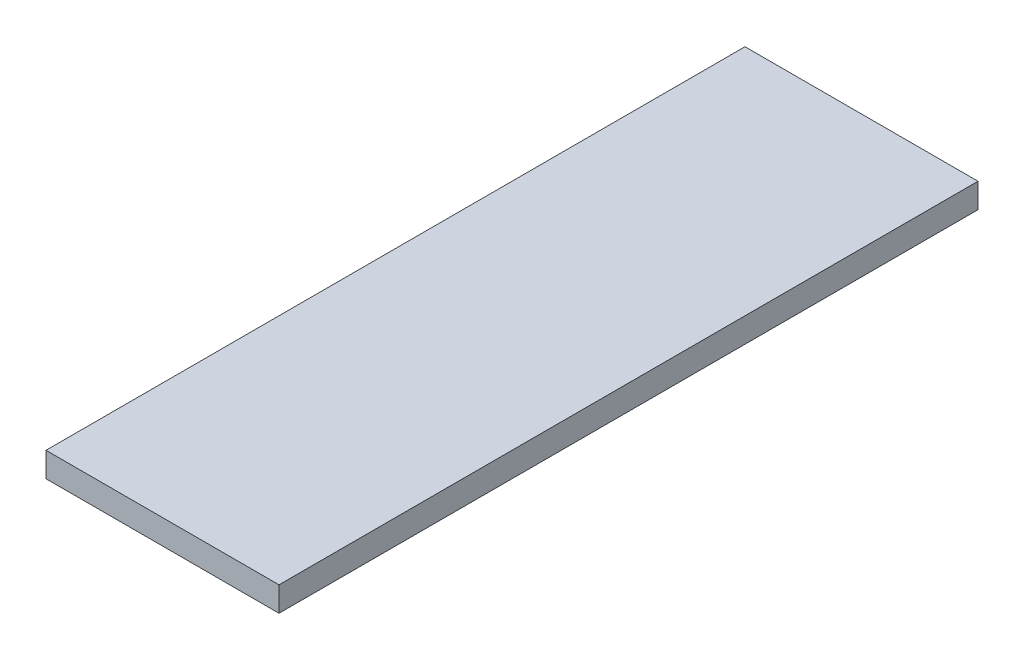
ISO-10303-21;
HEADER;
FILE_DESCRIPTION(('STEP AP214'),'2;1');
FILE_NAME('part.step','',(''),(''),'','','');
FILE_SCHEMA(('AUTOMOTIVE_DESIGN { 1 0 10303 214 1 1 1 1 }'));
ENDSEC;
DATA;
#1=APPLICATION_CONTEXT('core data for automotive mechanical design processes');
#2=APPLICATION_PROTOCOL_DEFINITION('international standard','automotive_design',2000,#1);
#3=PRODUCT_CONTEXT('',#1,'mechanical');
#4=PRODUCT('Part','Part','',(#3));
#5=PRODUCT_RELATED_PRODUCT_CATEGORY('part','',(#4));
#6=PRODUCT_DEFINITION_FORMATION('','',#4);
#7=PRODUCT_DEFINITION_CONTEXT('part definition',#1,'design');
#8=PRODUCT_DEFINITION('design','',#6,#7);
#9=PRODUCT_DEFINITION_SHAPE('','',#8);
#10=(LENGTH_UNIT() NAMED_UNIT(*) SI_UNIT(.MILLI.,.METRE.));
#11=(NAMED_UNIT(*) PLANE_ANGLE_UNIT() SI_UNIT($,.RADIAN.));
#12=(NAMED_UNIT(*) SI_UNIT($,.STERADIAN.) SOLID_ANGLE_UNIT());
#13=UNCERTAINTY_MEASURE_WITH_UNIT(LENGTH_MEASURE(1.E-05),#10,'distance_accuracy_value','');
#14=(GEOMETRIC_REPRESENTATION_CONTEXT(3) GLOBAL_UNCERTAINTY_ASSIGNED_CONTEXT((#13)) GLOBAL_UNIT_ASSIGNED_CONTEXT((#10,
#11,#12)) REPRESENTATION_CONTEXT('',''));
#15=CARTESIAN_POINT('',(0.,0.,0.));
#16=DIRECTION('',(0.,0.,1.));
#17=DIRECTION('',(1.,0.,0.));
#18=AXIS2_PLACEMENT_3D('',#15,#16,#17);
#19=CARTESIAN_POINT('',(0.,3.175,0.));
#20=DIRECTION('',(1.,0.,0.));
#21=DIRECTION('',(0.,0.,-1.));
#22=AXIS2_PLACEMENT_3D('',#19,#20,#21);
#23=PLANE('',#22);
#24=DIRECTION('',(0.,0.,1.));
#25=VECTOR('',#24,1.);
#26=CARTESIAN_POINT('',(0.,0.,0.));
#27=LINE('',#26,#25);
#28=CARTESIAN_POINT('',(0.,0.,-90.));
#29=VERTEX_POINT('',#28);
#30=CARTESIAN_POINT('',(0.,0.,0.));
#31=VERTEX_POINT('',#30);
#32=EDGE_CURVE('E96',#29,#31,#27,.T.);
#33=ORIENTED_EDGE('',*,*,#32,.T.);
#34=DIRECTION('',(0.,-1.,0.));
#35=VECTOR('',#34,1.);
#36=CARTESIAN_POINT('',(0.,3.175,0.));
#37=LINE('',#36,#35);
#38=CARTESIAN_POINT('',(0.,3.175,0.));
#39=VERTEX_POINT('',#38);
#40=EDGE_CURVE('E11',#39,#31,#37,.T.);
#41=ORIENTED_EDGE('',*,*,#40,.F.);
#42=DIRECTION('',(0.,0.,1.));
#43=VECTOR('',#42,1.);
#44=CARTESIAN_POINT('',(0.,3.175,0.));
#45=LINE('',#44,#43);
#46=CARTESIAN_POINT('',(0.,3.175,-90.));
#47=VERTEX_POINT('',#46);
#48=EDGE_CURVE('E84',#47,#39,#45,.T.);
#49=ORIENTED_EDGE('',*,*,#48,.F.);
#50=DIRECTION('',(0.,-1.,0.));
#51=VECTOR('',#50,1.);
#52=CARTESIAN_POINT('',(0.,3.175,-90.));
#53=LINE('',#52,#51);
#54=EDGE_CURVE('E92',#47,#29,#53,.T.);
#55=ORIENTED_EDGE('',*,*,#54,.T.);
#56=EDGE_LOOP('',(#33,#41,#49,#55));
#57=FACE_BOUND('',#56,.T.);
#58=ADVANCED_FACE('F33',(#57),#23,.F.);
#59=CARTESIAN_POINT('',(0.,3.175,0.));
#60=DIRECTION('',(0.,0.,-1.));
#61=DIRECTION('',(-1.,0.,0.));
#62=AXIS2_PLACEMENT_3D('',#59,#60,#61);
#63=PLANE('',#62);
#64=DIRECTION('',(1.,0.,0.));
#65=VECTOR('',#64,1.);
#66=CARTESIAN_POINT('',(0.,0.,0.));
#67=LINE('',#66,#65);
#68=CARTESIAN_POINT('',(30.,0.,0.));
#69=VERTEX_POINT('',#68);
#70=EDGE_CURVE('E88',#31,#69,#67,.T.);
#71=ORIENTED_EDGE('',*,*,#70,.T.);
#72=DIRECTION('',(0.,-1.,0.));
#73=VECTOR('',#72,1.);
#74=CARTESIAN_POINT('',(30.,3.175,0.));
#75=LINE('',#74,#73);
#76=CARTESIAN_POINT('',(30.,3.175,0.));
#77=VERTEX_POINT('',#76);
#78=EDGE_CURVE('E41',#77,#69,#75,.T.);
#79=ORIENTED_EDGE('',*,*,#78,.F.);
#80=DIRECTION('',(1.,0.,0.));
#81=VECTOR('',#80,1.);
#82=CARTESIAN_POINT('',(0.,3.175,0.));
#83=LINE('',#82,#81);
#84=EDGE_CURVE('E79',#39,#77,#83,.T.);
#85=ORIENTED_EDGE('',*,*,#84,.F.);
#86=ORIENTED_EDGE('',*,*,#40,.T.);
#87=EDGE_LOOP('',(#71,#79,#85,#86));
#88=FACE_BOUND('',#87,.T.);
#89=ADVANCED_FACE('F87',(#88),#63,.F.);
#90=CARTESIAN_POINT('',(30.,3.175,0.));
#91=DIRECTION('',(-1.,0.,0.));
#92=DIRECTION('',(0.,0.,1.));
#93=AXIS2_PLACEMENT_3D('',#90,#91,#92);
#94=PLANE('',#93);
#95=DIRECTION('',(0.,0.,-1.));
#96=VECTOR('',#95,1.);
#97=CARTESIAN_POINT('',(30.,0.,0.));
#98=LINE('',#97,#96);
#99=CARTESIAN_POINT('',(30.,0.,-90.));
#100=VERTEX_POINT('',#99);
#101=EDGE_CURVE('E66',#69,#100,#98,.T.);
#102=ORIENTED_EDGE('',*,*,#101,.T.);
#103=DIRECTION('',(0.,-1.,0.));
#104=VECTOR('',#103,1.);
#105=CARTESIAN_POINT('',(30.,3.175,-90.));
#106=LINE('',#105,#104);
#107=CARTESIAN_POINT('',(30.,3.175,-90.));
#108=VERTEX_POINT('',#107);
#109=EDGE_CURVE('E89',#108,#100,#106,.T.);
#110=ORIENTED_EDGE('',*,*,#109,.F.);
#111=DIRECTION('',(0.,0.,-1.));
#112=VECTOR('',#111,1.);
#113=CARTESIAN_POINT('',(30.,3.175,0.));
#114=LINE('',#113,#112);
#115=EDGE_CURVE('E82',#77,#108,#114,.T.);
#116=ORIENTED_EDGE('',*,*,#115,.F.);
#117=ORIENTED_EDGE('',*,*,#78,.T.);
#118=EDGE_LOOP('',(#102,#110,#116,#117));
#119=FACE_BOUND('',#118,.T.);
#120=ADVANCED_FACE('F90',(#119),#94,.F.);
#121=CARTESIAN_POINT('',(0.,3.175,-90.));
#122=DIRECTION('',(0.,0.,1.));
#123=DIRECTION('',(1.,0.,0.));
#124=AXIS2_PLACEMENT_3D('',#121,#122,#123);
#125=PLANE('',#124);
#126=DIRECTION('',(-1.,0.,0.));
#127=VECTOR('',#126,1.);
#128=CARTESIAN_POINT('',(0.,0.,-90.));
#129=LINE('',#128,#127);
#130=EDGE_CURVE('E72',#100,#29,#129,.T.);
#131=ORIENTED_EDGE('',*,*,#130,.T.);
#132=ORIENTED_EDGE('',*,*,#54,.F.);
#133=DIRECTION('',(-1.,0.,0.));
#134=VECTOR('',#133,1.);
#135=CARTESIAN_POINT('',(0.,3.175,-90.));
#136=LINE('',#135,#134);
#137=EDGE_CURVE('E49',#108,#47,#136,.T.);
#138=ORIENTED_EDGE('',*,*,#137,.F.);
#139=ORIENTED_EDGE('',*,*,#109,.T.);
#140=EDGE_LOOP('',(#131,#132,#138,#139));
#141=FACE_BOUND('',#140,.T.);
#142=ADVANCED_FACE('F103',(#141),#125,.F.);
#143=CARTESIAN_POINT('',(0.,3.175,0.));
#144=DIRECTION('',(0.,-1.,0.));
#145=DIRECTION('',(0.,0.,-1.));
#146=AXIS2_PLACEMENT_3D('',#143,#144,#145);
#147=PLANE('',#146);
#148=ORIENTED_EDGE('',*,*,#48,.T.);
#149=ORIENTED_EDGE('',*,*,#84,.T.);
#150=ORIENTED_EDGE('',*,*,#115,.T.);
#151=ORIENTED_EDGE('',*,*,#137,.T.);
#152=EDGE_LOOP('',(#148,#149,#150,#151));
#153=FACE_BOUND('',#152,.T.);
#154=ADVANCED_FACE('F80',(#153),#147,.F.);
#155=CARTESIAN_POINT('',(0.,0.,0.));
#156=DIRECTION('',(0.,-1.,0.));
#157=DIRECTION('',(0.,0.,-1.));
#158=AXIS2_PLACEMENT_3D('',#155,#156,#157);
#159=PLANE('',#158);
#160=ORIENTED_EDGE('',*,*,#32,.F.);
#161=ORIENTED_EDGE('',*,*,#130,.F.);
#162=ORIENTED_EDGE('',*,*,#101,.F.);
#163=ORIENTED_EDGE('',*,*,#70,.F.);
#164=EDGE_LOOP('',(#160,#161,#162,#163));
#165=FACE_BOUND('',#164,.T.);
#166=ADVANCED_FACE('F106',(#165),#159,.T.);
#167=CLOSED_SHELL('',(#58,#89,#120,#142,#154,#166));
#168=MANIFOLD_SOLID_BREP('B2',#167);
#169=ADVANCED_BREP_SHAPE_REPRESENTATION('',(#18,#168),#14);
#170=SHAPE_DEFINITION_REPRESENTATION(#9,#169);
ENDSEC;
END-ISO-10303-21;
